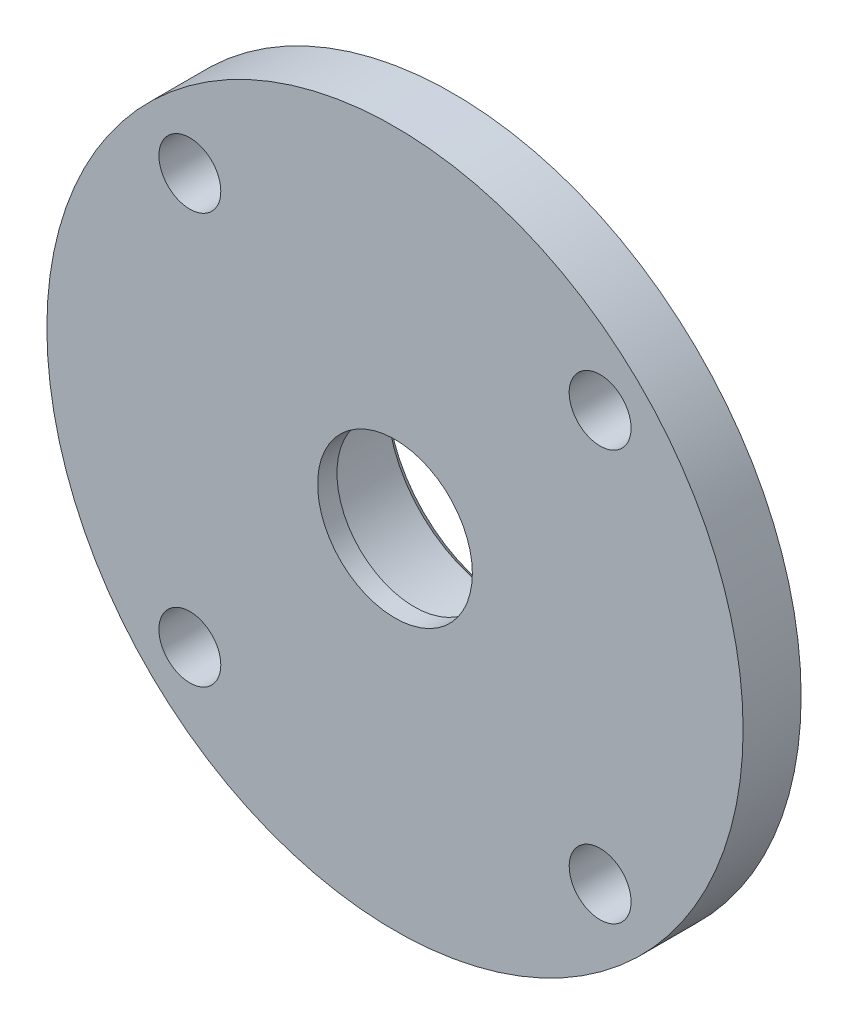
ISO-10303-21;
HEADER;
FILE_DESCRIPTION(('STEP AP214'),'2;1');
FILE_NAME('part.step','',(''),(''),'','','');
FILE_SCHEMA(('AUTOMOTIVE_DESIGN { 1 0 10303 214 1 1 1 1 }'));
ENDSEC;
DATA;
#1=APPLICATION_CONTEXT('core data for automotive mechanical design processes');
#2=APPLICATION_PROTOCOL_DEFINITION('international standard','automotive_design',2000,#1);
#3=PRODUCT_CONTEXT('',#1,'mechanical');
#4=PRODUCT('Part','Part','',(#3));
#5=PRODUCT_RELATED_PRODUCT_CATEGORY('part','',(#4));
#6=PRODUCT_DEFINITION_FORMATION('','',#4);
#7=PRODUCT_DEFINITION_CONTEXT('part definition',#1,'design');
#8=PRODUCT_DEFINITION('design','',#6,#7);
#9=PRODUCT_DEFINITION_SHAPE('','',#8);
#10=(LENGTH_UNIT() NAMED_UNIT(*) SI_UNIT(.MILLI.,.METRE.));
#11=(NAMED_UNIT(*) PLANE_ANGLE_UNIT() SI_UNIT($,.RADIAN.));
#12=(NAMED_UNIT(*) SI_UNIT($,.STERADIAN.) SOLID_ANGLE_UNIT());
#13=UNCERTAINTY_MEASURE_WITH_UNIT(LENGTH_MEASURE(1.E-05),#10,'distance_accuracy_value','');
#14=(GEOMETRIC_REPRESENTATION_CONTEXT(3) GLOBAL_UNCERTAINTY_ASSIGNED_CONTEXT((#13)) GLOBAL_UNIT_ASSIGNED_CONTEXT((#10,
#11,#12)) REPRESENTATION_CONTEXT('',''));
#15=CARTESIAN_POINT('',(0.,0.,0.));
#16=DIRECTION('',(0.,0.,1.));
#17=DIRECTION('',(1.,0.,0.));
#18=AXIS2_PLACEMENT_3D('',#15,#16,#17);
#19=CARTESIAN_POINT('',(0.,0.,0.));
#20=DIRECTION('',(0.,0.,0.999999999999967));
#21=DIRECTION('',(0.999999999999967,0.,0.));
#22=AXIS2_PLACEMENT_3D('',#19,#20,#21);
#23=CYLINDRICAL_SURFACE('',#22,4.);
#24=CARTESIAN_POINT('',(0.,0.,-1.));
#25=DIRECTION('',(0.,0.,0.999999999999967));
#26=DIRECTION('',(0.999999999999967,0.,0.));
#27=AXIS2_PLACEMENT_3D('',#24,#25,#26);
#28=CIRCLE('',#27,4.);
#29=CARTESIAN_POINT('',(3.99999999999987,0.,-1.));
#30=VERTEX_POINT('',#29);
#31=EDGE_CURVE('E81',#30,#30,#28,.T.);
#32=ORIENTED_EDGE('',*,*,#31,.F.);
#33=EDGE_LOOP('',(#32));
#34=FACE_BOUND('',#33,.T.);
#35=CARTESIAN_POINT('',(0.,0.,0.));
#36=DIRECTION('',(0.,0.,0.999999999999967));
#37=DIRECTION('',(0.999999999999967,0.,0.));
#38=AXIS2_PLACEMENT_3D('',#35,#36,#37);
#39=CIRCLE('',#38,4.);
#40=CARTESIAN_POINT('',(3.99999999999987,0.,0.));
#41=VERTEX_POINT('',#40);
#42=EDGE_CURVE('E66',#41,#41,#39,.T.);
#43=ORIENTED_EDGE('',*,*,#42,.T.);
#44=EDGE_LOOP('',(#43));
#45=FACE_BOUND('',#44,.T.);
#46=ADVANCED_FACE('F46',(#34,#45),#23,.F.);
#47=CARTESIAN_POINT('',(-4.,0.,0.));
#48=DIRECTION('',(0.,0.,-0.999999999999967));
#49=DIRECTION('',(-0.999999999999967,0.,0.));
#50=AXIS2_PLACEMENT_3D('',#47,#48,#49);
#51=PLANE('',#50);
#52=CARTESIAN_POINT('',(-10.6066017177983,10.6066017177981,0.));
#53=DIRECTION('',(0.,0.,0.999999999999967));
#54=DIRECTION('',(0.,1.,0.));
#55=AXIS2_PLACEMENT_3D('',#52,#53,#54);
#56=CIRCLE('',#55,1.6);
#57=CARTESIAN_POINT('',(-10.6066017177983,12.2066017177981,0.));
#58=VERTEX_POINT('',#57);
#59=EDGE_CURVE('E101',#58,#58,#56,.T.);
#60=ORIENTED_EDGE('',*,*,#59,.F.);
#61=EDGE_LOOP('',(#60));
#62=FACE_BOUND('',#61,.T.);
#63=CARTESIAN_POINT('',(-10.6066017177982,-10.6066017177984,0.));
#64=DIRECTION('',(0.,0.,0.999999999999967));
#65=DIRECTION('',(-0.999999999999967,0.,0.));
#66=AXIS2_PLACEMENT_3D('',#63,#64,#65);
#67=CIRCLE('',#66,1.6);
#68=CARTESIAN_POINT('',(-12.2066017177982,-10.6066017177984,0.));
#69=VERTEX_POINT('',#68);
#70=EDGE_CURVE('E94',#69,#69,#67,.T.);
#71=ORIENTED_EDGE('',*,*,#70,.F.);
#72=EDGE_LOOP('',(#71));
#73=FACE_BOUND('',#72,.T.);
#74=CARTESIAN_POINT('',(10.6066017177983,-10.6066017177983,0.));
#75=DIRECTION('',(0.,0.,0.999999999999967));
#76=DIRECTION('',(0.,-1.,0.));
#77=AXIS2_PLACEMENT_3D('',#74,#75,#76);
#78=CIRCLE('',#77,1.6);
#79=CARTESIAN_POINT('',(10.6066017177984,-12.2066017177983,0.));
#80=VERTEX_POINT('',#79);
#81=EDGE_CURVE('E95',#80,#80,#78,.T.);
#82=ORIENTED_EDGE('',*,*,#81,.F.);
#83=EDGE_LOOP('',(#82));
#84=FACE_BOUND('',#83,.T.);
#85=CARTESIAN_POINT('',(10.6066017177982,10.6066017177982,0.));
#86=DIRECTION('',(0.,0.,0.999999999999967));
#87=DIRECTION('',(0.999999999999967,0.,0.));
#88=AXIS2_PLACEMENT_3D('',#85,#86,#87);
#89=CIRCLE('',#88,1.6);
#90=CARTESIAN_POINT('',(12.2066017177982,10.6066017177982,0.));
#91=VERTEX_POINT('',#90);
#92=EDGE_CURVE('E87',#91,#91,#89,.T.);
#93=ORIENTED_EDGE('',*,*,#92,.F.);
#94=EDGE_LOOP('',(#93));
#95=FACE_BOUND('',#94,.T.);
#96=ORIENTED_EDGE('',*,*,#42,.F.);
#97=EDGE_LOOP('',(#96));
#98=FACE_BOUND('',#97,.T.);
#99=CARTESIAN_POINT('',(0.,0.,0.));
#100=DIRECTION('',(0.,0.,0.999999999999967));
#101=DIRECTION('',(0.999999999999967,0.,0.));
#102=AXIS2_PLACEMENT_3D('',#99,#100,#101);
#103=CIRCLE('',#102,18.);
#104=CARTESIAN_POINT('',(17.9999999999994,0.,0.));
#105=VERTEX_POINT('',#104);
#106=EDGE_CURVE('E69',#105,#105,#103,.T.);
#107=ORIENTED_EDGE('',*,*,#106,.T.);
#108=EDGE_LOOP('',(#107));
#109=FACE_BOUND('',#108,.T.);
#110=ADVANCED_FACE('F112',(#62,#73,#84,#95,#98,#109),#51,.F.);
#111=CARTESIAN_POINT('',(0.,0.,0.));
#112=DIRECTION('',(0.,0.,0.999999999999967));
#113=DIRECTION('',(0.999999999999967,0.,0.));
#114=AXIS2_PLACEMENT_3D('',#111,#112,#113);
#115=CYLINDRICAL_SURFACE('',#114,18.);
#116=ORIENTED_EDGE('',*,*,#106,.F.);
#117=EDGE_LOOP('',(#116));
#118=FACE_BOUND('',#117,.T.);
#119=CARTESIAN_POINT('',(0.,0.,-3.));
#120=DIRECTION('',(0.,0.,0.999999999999967));
#121=DIRECTION('',(0.999999999999967,0.,0.));
#122=AXIS2_PLACEMENT_3D('',#119,#120,#121);
#123=CIRCLE('',#122,18.);
#124=CARTESIAN_POINT('',(17.9999999999994,0.,-3.));
#125=VERTEX_POINT('',#124);
#126=EDGE_CURVE('E72',#125,#125,#123,.T.);
#127=ORIENTED_EDGE('',*,*,#126,.T.);
#128=EDGE_LOOP('',(#127));
#129=FACE_BOUND('',#128,.T.);
#130=ADVANCED_FACE('F115',(#118,#129),#115,.T.);
#131=CARTESIAN_POINT('',(-18.,0.,-3.));
#132=DIRECTION('',(0.,0.,0.999999999999967));
#133=DIRECTION('',(0.999999999999967,0.,0.));
#134=AXIS2_PLACEMENT_3D('',#131,#132,#133);
#135=PLANE('',#134);
#136=CARTESIAN_POINT('',(-10.6066017177983,10.6066017177981,-3.));
#137=DIRECTION('',(0.,0.,0.999999999999967));
#138=DIRECTION('',(0.999999999999967,0.,0.));
#139=AXIS2_PLACEMENT_3D('',#136,#137,#138);
#140=CIRCLE('',#139,1.6);
#141=CARTESIAN_POINT('',(-9.00660171779831,10.6066017177981,-3.));
#142=VERTEX_POINT('',#141);
#143=EDGE_CURVE('E90',#142,#142,#140,.F.);
#144=ORIENTED_EDGE('',*,*,#143,.F.);
#145=EDGE_LOOP('',(#144));
#146=FACE_BOUND('',#145,.T.);
#147=CARTESIAN_POINT('',(-10.6066017177982,-10.6066017177984,-3.));
#148=DIRECTION('',(0.,0.,0.999999999999967));
#149=DIRECTION('',(0.999999999999967,0.,0.));
#150=AXIS2_PLACEMENT_3D('',#147,#148,#149);
#151=CIRCLE('',#150,1.6);
#152=CARTESIAN_POINT('',(-9.00660171779825,-10.6066017177984,-3.));
#153=VERTEX_POINT('',#152);
#154=EDGE_CURVE('E98',#153,#153,#151,.F.);
#155=ORIENTED_EDGE('',*,*,#154,.F.);
#156=EDGE_LOOP('',(#155));
#157=FACE_BOUND('',#156,.T.);
#158=CARTESIAN_POINT('',(10.6066017177983,-10.6066017177983,-2.99999999999999));
#159=DIRECTION('',(0.,0.,0.999999999999967));
#160=DIRECTION('',(0.999999999999967,0.,0.));
#161=AXIS2_PLACEMENT_3D('',#158,#159,#160);
#162=CIRCLE('',#161,1.6);
#163=CARTESIAN_POINT('',(12.2066017177983,-10.6066017177983,-2.99999999999999));
#164=VERTEX_POINT('',#163);
#165=EDGE_CURVE('E91',#164,#164,#162,.F.);
#166=ORIENTED_EDGE('',*,*,#165,.F.);
#167=EDGE_LOOP('',(#166));
#168=FACE_BOUND('',#167,.T.);
#169=CARTESIAN_POINT('',(10.6066017177982,10.6066017177982,-3.));
#170=DIRECTION('',(0.,0.,0.999999999999967));
#171=DIRECTION('',(0.999999999999967,0.,0.));
#172=AXIS2_PLACEMENT_3D('',#169,#170,#171);
#173=CIRCLE('',#172,1.6);
#174=CARTESIAN_POINT('',(12.2066017177982,10.6066017177982,-3.));
#175=VERTEX_POINT('',#174);
#176=EDGE_CURVE('E84',#175,#175,#173,.F.);
#177=ORIENTED_EDGE('',*,*,#176,.F.);
#178=EDGE_LOOP('',(#177));
#179=FACE_BOUND('',#178,.T.);
#180=ORIENTED_EDGE('',*,*,#126,.F.);
#181=EDGE_LOOP('',(#180));
#182=FACE_BOUND('',#181,.T.);
#183=CARTESIAN_POINT('',(0.,0.,-3.));
#184=DIRECTION('',(0.,0.,0.999999999999967));
#185=DIRECTION('',(0.999999999999967,0.,0.));
#186=AXIS2_PLACEMENT_3D('',#183,#184,#185);
#187=CIRCLE('',#186,9.5);
#188=CARTESIAN_POINT('',(9.49999999999969,0.,-3.));
#189=VERTEX_POINT('',#188);
#190=EDGE_CURVE('E75',#189,#189,#187,.T.);
#191=ORIENTED_EDGE('',*,*,#190,.T.);
#192=EDGE_LOOP('',(#191));
#193=FACE_BOUND('',#192,.T.);
#194=ADVANCED_FACE('F129',(#146,#157,#168,#179,#182,#193),#135,.F.);
#195=CARTESIAN_POINT('',(0.,0.,0.));
#196=DIRECTION('',(0.,0.,0.999999999999967));
#197=DIRECTION('',(0.999999999999967,0.,0.));
#198=AXIS2_PLACEMENT_3D('',#195,#196,#197);
#199=CYLINDRICAL_SURFACE('',#198,9.5);
#200=CARTESIAN_POINT('',(0.,0.,-5.60000000000001));
#201=DIRECTION('',(0.,0.,0.999999999999967));
#202=DIRECTION('',(0.999999999999967,0.,0.));
#203=AXIS2_PLACEMENT_3D('',#200,#201,#202);
#204=CIRCLE('',#203,9.5);
#205=CARTESIAN_POINT('',(9.49999999999969,0.,-5.60000000000001));
#206=VERTEX_POINT('',#205);
#207=EDGE_CURVE('E61',#206,#206,#204,.T.);
#208=ORIENTED_EDGE('',*,*,#207,.T.);
#209=EDGE_LOOP('',(#208));
#210=FACE_BOUND('',#209,.T.);
#211=ORIENTED_EDGE('',*,*,#190,.F.);
#212=EDGE_LOOP('',(#211));
#213=FACE_BOUND('',#212,.T.);
#214=ADVANCED_FACE('F135',(#210,#213),#199,.T.);
#215=CARTESIAN_POINT('',(-9.50000000000001,0.,-6.00000000000001));
#216=DIRECTION('',(0.,0.,0.999999999999967));
#217=DIRECTION('',(0.999999999999967,0.,0.));
#218=AXIS2_PLACEMENT_3D('',#215,#216,#217);
#219=PLANE('',#218);
#220=CARTESIAN_POINT('',(0.,0.,-6.00000000000001));
#221=DIRECTION('',(0.,0.,0.999999999999967));
#222=DIRECTION('',(0.999999999999967,0.,0.));
#223=AXIS2_PLACEMENT_3D('',#220,#221,#222);
#224=CIRCLE('',#223,9.1);
#225=CARTESIAN_POINT('',(9.0999999999997,0.,-6.00000000000001));
#226=VERTEX_POINT('',#225);
#227=EDGE_CURVE('E53',#226,#226,#224,.F.);
#228=ORIENTED_EDGE('',*,*,#227,.T.);
#229=EDGE_LOOP('',(#228));
#230=FACE_BOUND('',#229,.T.);
#231=CARTESIAN_POINT('',(0.,0.,-6.00000000000001));
#232=DIRECTION('',(0.,0.,0.999999999999967));
#233=DIRECTION('',(0.999999999999967,0.,0.));
#234=AXIS2_PLACEMENT_3D('',#231,#232,#233);
#235=CIRCLE('',#234,6.4);
#236=CARTESIAN_POINT('',(6.39999999999979,0.,-6.00000000000001));
#237=VERTEX_POINT('',#236);
#238=EDGE_CURVE('E57',#237,#237,#235,.T.);
#239=ORIENTED_EDGE('',*,*,#238,.T.);
#240=EDGE_LOOP('',(#239));
#241=FACE_BOUND('',#240,.T.);
#242=ADVANCED_FACE('F141',(#230,#241),#219,.F.);
#243=CARTESIAN_POINT('',(0.,0.,0.));
#244=DIRECTION('',(0.,0.,0.999999999999967));
#245=DIRECTION('',(0.999999999999967,0.,0.));
#246=AXIS2_PLACEMENT_3D('',#243,#244,#245);
#247=CYLINDRICAL_SURFACE('',#246,6.);
#248=CARTESIAN_POINT('',(0.,0.,-5.59999999999999));
#249=DIRECTION('',(0.,0.,0.999999999999967));
#250=DIRECTION('',(0.999999999999967,0.,0.));
#251=AXIS2_PLACEMENT_3D('',#248,#249,#250);
#252=CIRCLE('',#251,6.);
#253=CARTESIAN_POINT('',(5.9999999999998,0.,-5.59999999999999));
#254=VERTEX_POINT('',#253);
#255=EDGE_CURVE('E12',#254,#254,#252,.F.);
#256=ORIENTED_EDGE('',*,*,#255,.T.);
#257=EDGE_LOOP('',(#256));
#258=FACE_BOUND('',#257,.T.);
#259=CARTESIAN_POINT('',(0.,0.,-1.));
#260=DIRECTION('',(0.,0.,0.999999999999967));
#261=DIRECTION('',(0.999999999999967,0.,0.));
#262=AXIS2_PLACEMENT_3D('',#259,#260,#261);
#263=CIRCLE('',#262,6.);
#264=CARTESIAN_POINT('',(5.9999999999998,0.,-1.));
#265=VERTEX_POINT('',#264);
#266=EDGE_CURVE('E78',#265,#265,#263,.T.);
#267=ORIENTED_EDGE('',*,*,#266,.T.);
#268=EDGE_LOOP('',(#267));
#269=FACE_BOUND('',#268,.T.);
#270=ADVANCED_FACE('F147',(#258,#269),#247,.F.);
#271=CARTESIAN_POINT('',(-6.00000000000001,0.,-1.));
#272=DIRECTION('',(0.,0.,0.999999999999967));
#273=DIRECTION('',(0.999999999999967,0.,0.));
#274=AXIS2_PLACEMENT_3D('',#271,#272,#273);
#275=PLANE('',#274);
#276=ORIENTED_EDGE('',*,*,#266,.F.);
#277=EDGE_LOOP('',(#276));
#278=FACE_BOUND('',#277,.T.);
#279=ORIENTED_EDGE('',*,*,#31,.T.);
#280=EDGE_LOOP('',(#279));
#281=FACE_BOUND('',#280,.T.);
#282=ADVANCED_FACE('F181',(#278,#281),#275,.F.);
#283=CARTESIAN_POINT('',(10.6066017177982,10.6066017177982,-6.00099999999999));
#284=DIRECTION('',(0.,0.,0.999999999999967));
#285=DIRECTION('',(0.999999999999967,0.,0.));
#286=AXIS2_PLACEMENT_3D('',#283,#284,#285);
#287=CYLINDRICAL_SURFACE('',#286,1.6);
#288=ORIENTED_EDGE('',*,*,#92,.T.);
#289=EDGE_LOOP('',(#288));
#290=FACE_BOUND('',#289,.T.);
#291=ORIENTED_EDGE('',*,*,#176,.T.);
#292=EDGE_LOOP('',(#291));
#293=FACE_BOUND('',#292,.T.);
#294=ADVANCED_FACE('F177',(#290,#293),#287,.F.);
#295=CARTESIAN_POINT('',(10.6066017177983,-10.6066017177983,-6.00099999999999));
#296=DIRECTION('',(0.,0.,0.999999999999967));
#297=DIRECTION('',(0.999999999999967,0.,0.));
#298=AXIS2_PLACEMENT_3D('',#295,#296,#297);
#299=CYLINDRICAL_SURFACE('',#298,1.6);
#300=ORIENTED_EDGE('',*,*,#81,.T.);
#301=EDGE_LOOP('',(#300));
#302=FACE_BOUND('',#301,.T.);
#303=ORIENTED_EDGE('',*,*,#165,.T.);
#304=EDGE_LOOP('',(#303));
#305=FACE_BOUND('',#304,.T.);
#306=ADVANCED_FACE('F171',(#302,#305),#299,.F.);
#307=CARTESIAN_POINT('',(-10.6066017177982,-10.6066017177984,-6.00100000000001));
#308=DIRECTION('',(0.,0.,0.999999999999967));
#309=DIRECTION('',(0.999999999999967,0.,0.));
#310=AXIS2_PLACEMENT_3D('',#307,#308,#309);
#311=CYLINDRICAL_SURFACE('',#310,1.6);
#312=ORIENTED_EDGE('',*,*,#70,.T.);
#313=EDGE_LOOP('',(#312));
#314=FACE_BOUND('',#313,.T.);
#315=ORIENTED_EDGE('',*,*,#154,.T.);
#316=EDGE_LOOP('',(#315));
#317=FACE_BOUND('',#316,.T.);
#318=ADVANCED_FACE('F164',(#314,#317),#311,.F.);
#319=CARTESIAN_POINT('',(-10.6066017177983,10.6066017177981,-6.00100000000001));
#320=DIRECTION('',(0.,0.,0.999999999999967));
#321=DIRECTION('',(0.999999999999967,0.,0.));
#322=AXIS2_PLACEMENT_3D('',#319,#320,#321);
#323=CYLINDRICAL_SURFACE('',#322,1.6);
#324=ORIENTED_EDGE('',*,*,#59,.T.);
#325=EDGE_LOOP('',(#324));
#326=FACE_BOUND('',#325,.T.);
#327=ORIENTED_EDGE('',*,*,#143,.T.);
#328=EDGE_LOOP('',(#327));
#329=FACE_BOUND('',#328,.T.);
#330=ADVANCED_FACE('F109',(#326,#329),#323,.F.);
#331=CARTESIAN_POINT('',(0.,0.,-5.60000000000001));
#332=DIRECTION('',(0.,0.,0.999999999999967));
#333=DIRECTION('',(0.999999999999967,0.,0.));
#334=AXIS2_PLACEMENT_3D('',#331,#332,#333);
#335=CONICAL_SURFACE('',#334,9.5,0.785398163397453);
#336=ORIENTED_EDGE('',*,*,#227,.F.);
#337=EDGE_LOOP('',(#336));
#338=FACE_BOUND('',#337,.T.);
#339=ORIENTED_EDGE('',*,*,#207,.F.);
#340=EDGE_LOOP('',(#339));
#341=FACE_BOUND('',#340,.T.);
#342=ADVANCED_FACE('F156',(#338,#341),#335,.T.);
#343=CARTESIAN_POINT('',(0.,0.,-6.00000000000001));
#344=DIRECTION('',(0.,0.,-0.999999999999967));
#345=DIRECTION('',(-0.999999999999967,0.,0.));
#346=AXIS2_PLACEMENT_3D('',#343,#344,#345);
#347=CONICAL_SURFACE('',#346,6.4,0.785398163397446);
#348=ORIENTED_EDGE('',*,*,#255,.F.);
#349=EDGE_LOOP('',(#348));
#350=FACE_BOUND('',#349,.T.);
#351=ORIENTED_EDGE('',*,*,#238,.F.);
#352=EDGE_LOOP('',(#351));
#353=FACE_BOUND('',#352,.T.);
#354=ADVANCED_FACE('F48',(#350,#353),#347,.F.);
#355=CLOSED_SHELL('',(#46,#110,#130,#194,#214,#242,#270,#282,#294,#306,#318,#330,#342,#354));
#356=MANIFOLD_SOLID_BREP('B2',#355);
#357=ADVANCED_BREP_SHAPE_REPRESENTATION('',(#18,#356),#14);
#358=SHAPE_DEFINITION_REPRESENTATION(#9,#357);
ENDSEC;
END-ISO-10303-21;
